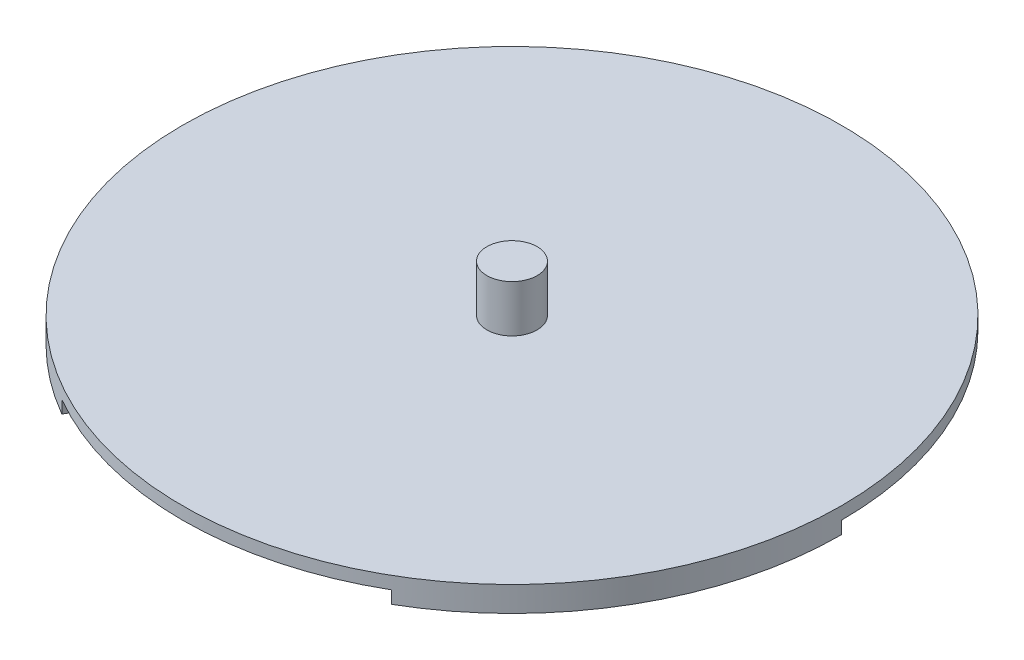
ISO-10303-21;
HEADER;
FILE_DESCRIPTION(('STEP AP214'),'2;1');
FILE_NAME('part.step','',(''),(''),'','','');
FILE_SCHEMA(('AUTOMOTIVE_DESIGN { 1 0 10303 214 1 1 1 1 }'));
ENDSEC;
DATA;
#1=APPLICATION_CONTEXT('core data for automotive mechanical design processes');
#2=APPLICATION_PROTOCOL_DEFINITION('international standard','automotive_design',2000,#1);
#3=PRODUCT_CONTEXT('',#1,'mechanical');
#4=PRODUCT('Part','Part','',(#3));
#5=PRODUCT_RELATED_PRODUCT_CATEGORY('part','',(#4));
#6=PRODUCT_DEFINITION_FORMATION('','',#4);
#7=PRODUCT_DEFINITION_CONTEXT('part definition',#1,'design');
#8=PRODUCT_DEFINITION('design','',#6,#7);
#9=PRODUCT_DEFINITION_SHAPE('','',#8);
#10=(LENGTH_UNIT() NAMED_UNIT(*) SI_UNIT(.MILLI.,.METRE.));
#11=(NAMED_UNIT(*) PLANE_ANGLE_UNIT() SI_UNIT($,.RADIAN.));
#12=(NAMED_UNIT(*) SI_UNIT($,.STERADIAN.) SOLID_ANGLE_UNIT());
#13=UNCERTAINTY_MEASURE_WITH_UNIT(LENGTH_MEASURE(1.E-05),#10,'distance_accuracy_value','');
#14=(GEOMETRIC_REPRESENTATION_CONTEXT(3) GLOBAL_UNCERTAINTY_ASSIGNED_CONTEXT((#13)) GLOBAL_UNIT_ASSIGNED_CONTEXT((#10,
#11,#12)) REPRESENTATION_CONTEXT('',''));
#15=CARTESIAN_POINT('',(0.,0.,0.));
#16=DIRECTION('',(0.,0.,1.));
#17=DIRECTION('',(1.,0.,0.));
#18=AXIS2_PLACEMENT_3D('',#15,#16,#17);
#19=CARTESIAN_POINT('',(0.,4.,0.));
#20=DIRECTION('',(0.,-1.,0.));
#21=DIRECTION('',(1.,0.,0.));
#22=AXIS2_PLACEMENT_3D('',#19,#20,#21);
#23=PLANE('',#22);
#24=CARTESIAN_POINT('',(0.,4.,0.));
#25=DIRECTION('',(0.,1.,0.));
#26=DIRECTION('',(1.,0.,0.));
#27=AXIS2_PLACEMENT_3D('',#24,#25,#26);
#28=CIRCLE('',#27,92.5);
#29=CARTESIAN_POINT('',(46.25,4.,-80.1073498500606));
#30=VERTEX_POINT('',#29);
#31=CARTESIAN_POINT('',(-46.25,4.,-80.1073498500605));
#32=VERTEX_POINT('',#31);
#33=EDGE_CURVE('E54',#30,#32,#28,.T.);
#34=ORIENTED_EDGE('',*,*,#33,.F.);
#35=DIRECTION('',(-0.5,0.,0.866025403784439));
#36=VECTOR('',#35,1.);
#37=CARTESIAN_POINT('',(46.25,4.,-80.1073498500606));
#38=LINE('',#37,#36);
#39=CARTESIAN_POINT('',(52.4999999999999,4.,-90.932667397366));
#40=VERTEX_POINT('',#39);
#41=EDGE_CURVE('E260',#40,#30,#38,.T.);
#42=ORIENTED_EDGE('',*,*,#41,.F.);
#43=CARTESIAN_POINT('',(0.,4.,0.));
#44=DIRECTION('',(0.,-1.,0.));
#45=DIRECTION('',(1.,0.,0.));
#46=AXIS2_PLACEMENT_3D('',#43,#44,#45);
#47=CIRCLE('',#46,105.);
#48=CARTESIAN_POINT('',(105.,4.,0.));
#49=VERTEX_POINT('',#48);
#50=EDGE_CURVE('E149',#40,#49,#47,.T.);
#51=ORIENTED_EDGE('',*,*,#50,.T.);
#52=DIRECTION('',(-1.,0.,0.));
#53=VECTOR('',#52,1.);
#54=CARTESIAN_POINT('',(105.,4.,0.));
#55=LINE('',#54,#53);
#56=CARTESIAN_POINT('',(92.5,4.,0.));
#57=VERTEX_POINT('',#56);
#58=EDGE_CURVE('E192',#49,#57,#55,.T.);
#59=ORIENTED_EDGE('',*,*,#58,.T.);
#60=CARTESIAN_POINT('',(0.,4.,0.));
#61=DIRECTION('',(0.,-1.,0.));
#62=DIRECTION('',(1.,0.,0.));
#63=AXIS2_PLACEMENT_3D('',#60,#61,#62);
#64=CIRCLE('',#63,92.5);
#65=CARTESIAN_POINT('',(46.25,4.,80.1073498500606));
#66=VERTEX_POINT('',#65);
#67=EDGE_CURVE('E182',#57,#66,#64,.T.);
#68=ORIENTED_EDGE('',*,*,#67,.T.);
#69=DIRECTION('',(0.5,0.,0.866025403784439));
#70=VECTOR('',#69,1.);
#71=CARTESIAN_POINT('',(46.25,4.,80.1073498500606));
#72=LINE('',#71,#70);
#73=CARTESIAN_POINT('',(52.4999999999999,4.,90.932667397366));
#74=VERTEX_POINT('',#73);
#75=EDGE_CURVE('E185',#66,#74,#72,.T.);
#76=ORIENTED_EDGE('',*,*,#75,.T.);
#77=CARTESIAN_POINT('',(-52.5,4.,90.9326673973661));
#78=VERTEX_POINT('',#77);
#79=EDGE_CURVE('E189',#74,#78,#47,.T.);
#80=ORIENTED_EDGE('',*,*,#79,.T.);
#81=DIRECTION('',(-0.5,0.,0.866025403784439));
#82=VECTOR('',#81,1.);
#83=CARTESIAN_POINT('',(-52.5,4.,90.9326673973661));
#84=LINE('',#83,#82);
#85=CARTESIAN_POINT('',(-46.25,4.,80.1073498500607));
#86=VERTEX_POINT('',#85);
#87=EDGE_CURVE('E153',#86,#78,#84,.T.);
#88=ORIENTED_EDGE('',*,*,#87,.F.);
#89=CARTESIAN_POINT('',(0.,4.,0.));
#90=DIRECTION('',(0.,1.,0.));
#91=DIRECTION('',(1.,0.,0.));
#92=AXIS2_PLACEMENT_3D('',#89,#90,#91);
#93=CIRCLE('',#92,92.5);
#94=CARTESIAN_POINT('',(-92.5000000000001,4.,0.));
#95=VERTEX_POINT('',#94);
#96=EDGE_CURVE('E150',#95,#86,#93,.T.);
#97=ORIENTED_EDGE('',*,*,#96,.F.);
#98=DIRECTION('',(1.,0.,0.));
#99=VECTOR('',#98,1.);
#100=CARTESIAN_POINT('',(-92.5000000000001,4.,0.));
#101=LINE('',#100,#99);
#102=CARTESIAN_POINT('',(-105.,4.,0.));
#103=VERTEX_POINT('',#102);
#104=EDGE_CURVE('E163',#103,#95,#101,.T.);
#105=ORIENTED_EDGE('',*,*,#104,.F.);
#106=CARTESIAN_POINT('',(-52.5,4.,-90.932667397366));
#107=VERTEX_POINT('',#106);
#108=EDGE_CURVE('E193',#103,#107,#47,.T.);
#109=ORIENTED_EDGE('',*,*,#108,.T.);
#110=DIRECTION('',(-0.499999999999999,0.,-0.866025403784439));
#111=VECTOR('',#110,1.);
#112=CARTESIAN_POINT('',(-52.5,4.,-90.932667397366));
#113=LINE('',#112,#111);
#114=EDGE_CURVE('E59',#32,#107,#113,.T.);
#115=ORIENTED_EDGE('',*,*,#114,.F.);
#116=EDGE_LOOP('',(#34,#42,#51,#59,#68,#76,#80,#88,#97,#105,#109,#115));
#117=FACE_BOUND('',#116,.T.);
#118=ADVANCED_FACE('F39',(#117),#23,.T.);
#119=CARTESIAN_POINT('',(0.,8.,0.));
#120=DIRECTION('',(0.,-1.,0.));
#121=DIRECTION('',(1.,0.,0.));
#122=AXIS2_PLACEMENT_3D('',#119,#120,#121);
#123=CYLINDRICAL_SURFACE('',#122,105.);
#124=DIRECTION('',(0.,-1.,0.));
#125=VECTOR('',#124,1.);
#126=CARTESIAN_POINT('',(105.,4.,0.));
#127=LINE('',#126,#125);
#128=CARTESIAN_POINT('',(105.,0.,0.));
#129=VERTEX_POINT('',#128);
#130=EDGE_CURVE('E205',#49,#129,#127,.T.);
#131=ORIENTED_EDGE('',*,*,#130,.F.);
#132=ORIENTED_EDGE('',*,*,#50,.F.);
#133=DIRECTION('',(0.,1.,0.));
#134=VECTOR('',#133,1.);
#135=CARTESIAN_POINT('',(52.4999999999999,0.,-90.932667397366));
#136=LINE('',#135,#134);
#137=CARTESIAN_POINT('',(52.4999999999999,0.,-90.932667397366));
#138=VERTEX_POINT('',#137);
#139=EDGE_CURVE('E131',#138,#40,#136,.T.);
#140=ORIENTED_EDGE('',*,*,#139,.F.);
#141=CARTESIAN_POINT('',(0.,0.,0.));
#142=DIRECTION('',(0.,-1.,0.));
#143=DIRECTION('',(-1.,0.,0.));
#144=AXIS2_PLACEMENT_3D('',#141,#142,#143);
#145=CIRCLE('',#144,105.);
#146=CARTESIAN_POINT('',(-52.5,0.,-90.932667397366));
#147=VERTEX_POINT('',#146);
#148=EDGE_CURVE('E137',#147,#138,#145,.T.);
#149=ORIENTED_EDGE('',*,*,#148,.F.);
#150=DIRECTION('',(0.,1.,0.));
#151=VECTOR('',#150,1.);
#152=CARTESIAN_POINT('',(-52.5,0.,-90.932667397366));
#153=LINE('',#152,#151);
#154=EDGE_CURVE('E268',#147,#107,#153,.T.);
#155=ORIENTED_EDGE('',*,*,#154,.T.);
#156=ORIENTED_EDGE('',*,*,#108,.F.);
#157=DIRECTION('',(0.,1.,0.));
#158=VECTOR('',#157,1.);
#159=CARTESIAN_POINT('',(-105.,0.,0.));
#160=LINE('',#159,#158);
#161=CARTESIAN_POINT('',(-105.,0.,0.));
#162=VERTEX_POINT('',#161);
#163=EDGE_CURVE('E174',#162,#103,#160,.T.);
#164=ORIENTED_EDGE('',*,*,#163,.F.);
#165=CARTESIAN_POINT('',(0.,0.,0.));
#166=DIRECTION('',(0.,-1.,0.));
#167=DIRECTION('',(-1.,0.,0.));
#168=AXIS2_PLACEMENT_3D('',#165,#166,#167);
#169=CIRCLE('',#168,105.);
#170=CARTESIAN_POINT('',(-52.5,0.,90.9326673973661));
#171=VERTEX_POINT('',#170);
#172=EDGE_CURVE('E165',#171,#162,#169,.T.);
#173=ORIENTED_EDGE('',*,*,#172,.F.);
#174=DIRECTION('',(0.,1.,0.));
#175=VECTOR('',#174,1.);
#176=CARTESIAN_POINT('',(-52.5,0.,90.9326673973661));
#177=LINE('',#176,#175);
#178=EDGE_CURVE('E176',#171,#78,#177,.T.);
#179=ORIENTED_EDGE('',*,*,#178,.T.);
#180=ORIENTED_EDGE('',*,*,#79,.F.);
#181=DIRECTION('',(0.,-1.,0.));
#182=VECTOR('',#181,1.);
#183=CARTESIAN_POINT('',(52.4999999999999,4.,90.932667397366));
#184=LINE('',#183,#182);
#185=CARTESIAN_POINT('',(52.4999999999999,0.,90.932667397366));
#186=VERTEX_POINT('',#185);
#187=EDGE_CURVE('E207',#74,#186,#184,.T.);
#188=ORIENTED_EDGE('',*,*,#187,.T.);
#189=CARTESIAN_POINT('',(0.,0.,0.));
#190=DIRECTION('',(0.,-1.,0.));
#191=DIRECTION('',(1.,0.,0.));
#192=AXIS2_PLACEMENT_3D('',#189,#190,#191);
#193=CIRCLE('',#192,105.);
#194=EDGE_CURVE('E204',#129,#186,#193,.T.);
#195=ORIENTED_EDGE('',*,*,#194,.F.);
#196=EDGE_LOOP('',(#131,#132,#140,#149,#155,#156,#164,#173,#179,#180,#188,#195));
#197=FACE_BOUND('',#196,.T.);
#198=CARTESIAN_POINT('',(0.,8.,0.));
#199=DIRECTION('',(0.,-1.,0.));
#200=DIRECTION('',(1.,0.,0.));
#201=AXIS2_PLACEMENT_3D('',#198,#199,#200);
#202=CIRCLE('',#201,105.);
#203=CARTESIAN_POINT('',(105.,8.,0.));
#204=VERTEX_POINT('',#203);
#205=EDGE_CURVE('E47',#204,#204,#202,.T.);
#206=ORIENTED_EDGE('',*,*,#205,.T.);
#207=EDGE_LOOP('',(#206));
#208=FACE_BOUND('',#207,.T.);
#209=ADVANCED_FACE('F41',(#197,#208),#123,.T.);
#210=CARTESIAN_POINT('',(105.,8.,0.));
#211=DIRECTION('',(0.,1.,0.));
#212=DIRECTION('',(-1.,0.,0.));
#213=AXIS2_PLACEMENT_3D('',#210,#211,#212);
#214=PLANE('',#213);
#215=CARTESIAN_POINT('',(0.,8.,0.));
#216=DIRECTION('',(0.,1.,0.));
#217=DIRECTION('',(-1.,0.,0.));
#218=AXIS2_PLACEMENT_3D('',#215,#216,#217);
#219=CIRCLE('',#218,7.99999999999999);
#220=CARTESIAN_POINT('',(-7.99999999999999,8.,0.));
#221=VERTEX_POINT('',#220);
#222=EDGE_CURVE('E11',#221,#221,#219,.T.);
#223=ORIENTED_EDGE('',*,*,#222,.F.);
#224=EDGE_LOOP('',(#223));
#225=FACE_BOUND('',#224,.T.);
#226=ORIENTED_EDGE('',*,*,#205,.F.);
#227=EDGE_LOOP('',(#226));
#228=FACE_BOUND('',#227,.T.);
#229=ADVANCED_FACE('F216',(#225,#228),#214,.T.);
#230=CARTESIAN_POINT('',(0.,0.,0.));
#231=DIRECTION('',(0.,-1.,0.));
#232=DIRECTION('',(1.,0.,0.));
#233=AXIS2_PLACEMENT_3D('',#230,#231,#232);
#234=PLANE('',#233);
#235=DIRECTION('',(-1.,0.,0.));
#236=VECTOR('',#235,1.);
#237=CARTESIAN_POINT('',(105.,0.,0.));
#238=LINE('',#237,#236);
#239=CARTESIAN_POINT('',(92.5,0.,0.));
#240=VERTEX_POINT('',#239);
#241=EDGE_CURVE('E186',#129,#240,#238,.T.);
#242=ORIENTED_EDGE('',*,*,#241,.F.);
#243=ORIENTED_EDGE('',*,*,#194,.T.);
#244=DIRECTION('',(0.5,0.,0.866025403784439));
#245=VECTOR('',#244,1.);
#246=CARTESIAN_POINT('',(46.25,0.,80.1073498500606));
#247=LINE('',#246,#245);
#248=CARTESIAN_POINT('',(46.25,0.,80.1073498500606));
#249=VERTEX_POINT('',#248);
#250=EDGE_CURVE('E198',#249,#186,#247,.T.);
#251=ORIENTED_EDGE('',*,*,#250,.F.);
#252=CARTESIAN_POINT('',(0.,0.,0.));
#253=DIRECTION('',(0.,-1.,0.));
#254=DIRECTION('',(1.,0.,0.));
#255=AXIS2_PLACEMENT_3D('',#252,#253,#254);
#256=CIRCLE('',#255,92.5);
#257=EDGE_CURVE('E181',#240,#249,#256,.T.);
#258=ORIENTED_EDGE('',*,*,#257,.F.);
#259=EDGE_LOOP('',(#242,#243,#251,#258));
#260=FACE_BOUND('',#259,.T.);
#261=ADVANCED_FACE('F218',(#260),#234,.T.);
#262=CARTESIAN_POINT('',(0.,4.,0.));
#263=DIRECTION('',(0.,-1.,0.));
#264=DIRECTION('',(1.,0.,0.));
#265=AXIS2_PLACEMENT_3D('',#262,#263,#264);
#266=CYLINDRICAL_SURFACE('',#265,92.5);
#267=ORIENTED_EDGE('',*,*,#257,.T.);
#268=DIRECTION('',(0.,-1.,0.));
#269=VECTOR('',#268,1.);
#270=CARTESIAN_POINT('',(46.25,4.,80.1073498500606));
#271=LINE('',#270,#269);
#272=EDGE_CURVE('E196',#66,#249,#271,.T.);
#273=ORIENTED_EDGE('',*,*,#272,.F.);
#274=ORIENTED_EDGE('',*,*,#67,.F.);
#275=DIRECTION('',(0.,-1.,0.));
#276=VECTOR('',#275,1.);
#277=CARTESIAN_POINT('',(92.5,4.,0.));
#278=LINE('',#277,#276);
#279=EDGE_CURVE('E202',#57,#240,#278,.T.);
#280=ORIENTED_EDGE('',*,*,#279,.T.);
#281=EDGE_LOOP('',(#267,#273,#274,#280));
#282=FACE_BOUND('',#281,.T.);
#283=ADVANCED_FACE('F225',(#282),#266,.F.);
#284=CARTESIAN_POINT('',(105.,4.,0.));
#285=DIRECTION('',(0.,0.,1.));
#286=DIRECTION('',(1.,0.,0.));
#287=AXIS2_PLACEMENT_3D('',#284,#285,#286);
#288=PLANE('',#287);
#289=ORIENTED_EDGE('',*,*,#241,.T.);
#290=ORIENTED_EDGE('',*,*,#279,.F.);
#291=ORIENTED_EDGE('',*,*,#58,.F.);
#292=ORIENTED_EDGE('',*,*,#130,.T.);
#293=EDGE_LOOP('',(#289,#290,#291,#292));
#294=FACE_BOUND('',#293,.T.);
#295=ADVANCED_FACE('F239',(#294),#288,.F.);
#296=CARTESIAN_POINT('',(46.25,4.,80.1073498500606));
#297=DIRECTION('',(0.866025403784439,0.,-0.5));
#298=DIRECTION('',(-0.5,0.,-0.866025403784439));
#299=AXIS2_PLACEMENT_3D('',#296,#297,#298);
#300=PLANE('',#299);
#301=ORIENTED_EDGE('',*,*,#250,.T.);
#302=ORIENTED_EDGE('',*,*,#187,.F.);
#303=ORIENTED_EDGE('',*,*,#75,.F.);
#304=ORIENTED_EDGE('',*,*,#272,.T.);
#305=EDGE_LOOP('',(#301,#302,#303,#304));
#306=FACE_BOUND('',#305,.T.);
#307=ADVANCED_FACE('F242',(#306),#300,.F.);
#308=CARTESIAN_POINT('',(0.,0.,0.));
#309=DIRECTION('',(0.,1.,0.));
#310=DIRECTION('',(-1.,0.,0.));
#311=AXIS2_PLACEMENT_3D('',#308,#309,#310);
#312=CYLINDRICAL_SURFACE('',#311,92.5);
#313=ORIENTED_EDGE('',*,*,#96,.T.);
#314=DIRECTION('',(0.,1.,0.));
#315=VECTOR('',#314,1.);
#316=CARTESIAN_POINT('',(-46.25,0.,80.1073498500607));
#317=LINE('',#316,#315);
#318=CARTESIAN_POINT('',(-46.25,0.,80.1073498500607));
#319=VERTEX_POINT('',#318);
#320=EDGE_CURVE('E179',#319,#86,#317,.T.);
#321=ORIENTED_EDGE('',*,*,#320,.F.);
#322=CARTESIAN_POINT('',(0.,0.,0.));
#323=DIRECTION('',(0.,1.,0.));
#324=DIRECTION('',(1.,0.,0.));
#325=AXIS2_PLACEMENT_3D('',#322,#323,#324);
#326=CIRCLE('',#325,92.5);
#327=CARTESIAN_POINT('',(-92.5000000000001,0.,0.));
#328=VERTEX_POINT('',#327);
#329=EDGE_CURVE('E159',#328,#319,#326,.T.);
#330=ORIENTED_EDGE('',*,*,#329,.F.);
#331=DIRECTION('',(0.,1.,0.));
#332=VECTOR('',#331,1.);
#333=CARTESIAN_POINT('',(-92.5000000000001,0.,0.));
#334=LINE('',#333,#332);
#335=EDGE_CURVE('E168',#328,#95,#334,.T.);
#336=ORIENTED_EDGE('',*,*,#335,.T.);
#337=EDGE_LOOP('',(#313,#321,#330,#336));
#338=FACE_BOUND('',#337,.T.);
#339=ADVANCED_FACE('F237',(#338),#312,.F.);
#340=CARTESIAN_POINT('',(-52.5,0.,90.9326673973661));
#341=DIRECTION('',(-0.866025403784439,0.,-0.5));
#342=DIRECTION('',(-0.5,0.,0.866025403784439));
#343=AXIS2_PLACEMENT_3D('',#340,#341,#342);
#344=PLANE('',#343);
#345=ORIENTED_EDGE('',*,*,#87,.T.);
#346=ORIENTED_EDGE('',*,*,#178,.F.);
#347=DIRECTION('',(-0.5,0.,0.866025403784439));
#348=VECTOR('',#347,1.);
#349=CARTESIAN_POINT('',(-52.5,0.,90.9326673973661));
#350=LINE('',#349,#348);
#351=EDGE_CURVE('E162',#319,#171,#350,.T.);
#352=ORIENTED_EDGE('',*,*,#351,.F.);
#353=ORIENTED_EDGE('',*,*,#320,.T.);
#354=EDGE_LOOP('',(#345,#346,#352,#353));
#355=FACE_BOUND('',#354,.T.);
#356=ADVANCED_FACE('F305',(#355),#344,.F.);
#357=CARTESIAN_POINT('',(-92.5000000000001,0.,0.));
#358=DIRECTION('',(0.,0.,1.));
#359=DIRECTION('',(1.,0.,0.));
#360=AXIS2_PLACEMENT_3D('',#357,#358,#359);
#361=PLANE('',#360);
#362=ORIENTED_EDGE('',*,*,#104,.T.);
#363=ORIENTED_EDGE('',*,*,#335,.F.);
#364=DIRECTION('',(1.,0.,0.));
#365=VECTOR('',#364,1.);
#366=CARTESIAN_POINT('',(-92.5000000000001,0.,0.));
#367=LINE('',#366,#365);
#368=EDGE_CURVE('E167',#162,#328,#367,.T.);
#369=ORIENTED_EDGE('',*,*,#368,.F.);
#370=ORIENTED_EDGE('',*,*,#163,.T.);
#371=EDGE_LOOP('',(#362,#363,#369,#370));
#372=FACE_BOUND('',#371,.T.);
#373=ADVANCED_FACE('F302',(#372),#361,.F.);
#374=CARTESIAN_POINT('',(0.,0.,0.));
#375=DIRECTION('',(0.,-1.,0.));
#376=DIRECTION('',(1.,0.,0.));
#377=AXIS2_PLACEMENT_3D('',#374,#375,#376);
#378=PLANE('',#377);
#379=ORIENTED_EDGE('',*,*,#329,.T.);
#380=ORIENTED_EDGE('',*,*,#351,.T.);
#381=ORIENTED_EDGE('',*,*,#172,.T.);
#382=ORIENTED_EDGE('',*,*,#368,.T.);
#383=EDGE_LOOP('',(#379,#380,#381,#382));
#384=FACE_BOUND('',#383,.T.);
#385=ADVANCED_FACE('F300',(#384),#378,.T.);
#386=CARTESIAN_POINT('',(46.25,0.,-80.1073498500606));
#387=DIRECTION('',(-0.866025403784439,0.,-0.499999999999999));
#388=DIRECTION('',(-0.5,0.,0.866025403784439));
#389=AXIS2_PLACEMENT_3D('',#386,#387,#388);
#390=PLANE('',#389);
#391=ORIENTED_EDGE('',*,*,#41,.T.);
#392=DIRECTION('',(0.,1.,0.));
#393=VECTOR('',#392,1.);
#394=CARTESIAN_POINT('',(46.25,0.,-80.1073498500606));
#395=LINE('',#394,#393);
#396=CARTESIAN_POINT('',(46.25,0.,-80.1073498500606));
#397=VERTEX_POINT('',#396);
#398=EDGE_CURVE('E133',#397,#30,#395,.T.);
#399=ORIENTED_EDGE('',*,*,#398,.F.);
#400=DIRECTION('',(-0.5,0.,0.866025403784439));
#401=VECTOR('',#400,1.);
#402=CARTESIAN_POINT('',(46.25,0.,-80.1073498500606));
#403=LINE('',#402,#401);
#404=EDGE_CURVE('E127',#138,#397,#403,.T.);
#405=ORIENTED_EDGE('',*,*,#404,.F.);
#406=ORIENTED_EDGE('',*,*,#139,.T.);
#407=EDGE_LOOP('',(#391,#399,#405,#406));
#408=FACE_BOUND('',#407,.T.);
#409=ADVANCED_FACE('F129',(#408),#390,.F.);
#410=CARTESIAN_POINT('',(0.,0.,0.));
#411=DIRECTION('',(0.,1.,0.));
#412=DIRECTION('',(-1.,0.,0.));
#413=AXIS2_PLACEMENT_3D('',#410,#411,#412);
#414=CYLINDRICAL_SURFACE('',#413,92.5);
#415=ORIENTED_EDGE('',*,*,#33,.T.);
#416=DIRECTION('',(0.,1.,0.));
#417=VECTOR('',#416,1.);
#418=CARTESIAN_POINT('',(-46.2500000000001,0.,-80.1073498500606));
#419=LINE('',#418,#417);
#420=CARTESIAN_POINT('',(-46.2500000000001,0.,-80.1073498500606));
#421=VERTEX_POINT('',#420);
#422=EDGE_CURVE('E155',#421,#32,#419,.T.);
#423=ORIENTED_EDGE('',*,*,#422,.F.);
#424=CARTESIAN_POINT('',(0.,0.,0.));
#425=DIRECTION('',(0.,1.,0.));
#426=DIRECTION('',(1.,0.,0.));
#427=AXIS2_PLACEMENT_3D('',#424,#425,#426);
#428=CIRCLE('',#427,92.5);
#429=EDGE_CURVE('E136',#397,#421,#428,.T.);
#430=ORIENTED_EDGE('',*,*,#429,.F.);
#431=ORIENTED_EDGE('',*,*,#398,.T.);
#432=EDGE_LOOP('',(#415,#423,#430,#431));
#433=FACE_BOUND('',#432,.T.);
#434=ADVANCED_FACE('F294',(#433),#414,.F.);
#435=CARTESIAN_POINT('',(-52.5,0.,-90.932667397366));
#436=DIRECTION('',(0.866025403784439,0.,-0.499999999999999));
#437=DIRECTION('',(-0.499999999999999,0.,-0.866025403784439));
#438=AXIS2_PLACEMENT_3D('',#435,#436,#437);
#439=PLANE('',#438);
#440=ORIENTED_EDGE('',*,*,#114,.T.);
#441=ORIENTED_EDGE('',*,*,#154,.F.);
#442=DIRECTION('',(-0.499999999999999,0.,-0.866025403784439));
#443=VECTOR('',#442,1.);
#444=CARTESIAN_POINT('',(-52.5,0.,-90.932667397366));
#445=LINE('',#444,#443);
#446=EDGE_CURVE('E142',#421,#147,#445,.T.);
#447=ORIENTED_EDGE('',*,*,#446,.F.);
#448=ORIENTED_EDGE('',*,*,#422,.T.);
#449=EDGE_LOOP('',(#440,#441,#447,#448));
#450=FACE_BOUND('',#449,.T.);
#451=ADVANCED_FACE('F267',(#450),#439,.F.);
#452=CARTESIAN_POINT('',(0.,0.,0.));
#453=DIRECTION('',(0.,1.,0.));
#454=DIRECTION('',(-1.,0.,0.));
#455=AXIS2_PLACEMENT_3D('',#452,#453,#454);
#456=PLANE('',#455);
#457=ORIENTED_EDGE('',*,*,#148,.T.);
#458=ORIENTED_EDGE('',*,*,#404,.T.);
#459=ORIENTED_EDGE('',*,*,#429,.T.);
#460=ORIENTED_EDGE('',*,*,#446,.T.);
#461=EDGE_LOOP('',(#457,#458,#459,#460));
#462=FACE_BOUND('',#461,.T.);
#463=ADVANCED_FACE('F140',(#462),#456,.F.);
#464=CARTESIAN_POINT('',(0.,23.,0.));
#465=DIRECTION('',(0.,-1.,0.));
#466=DIRECTION('',(0.,0.,-1.));
#467=AXIS2_PLACEMENT_3D('',#464,#465,#466);
#468=CYLINDRICAL_SURFACE('',#467,7.99999999999999);
#469=CARTESIAN_POINT('',(0.,23.,0.));
#470=DIRECTION('',(0.,-1.,0.));
#471=DIRECTION('',(0.,0.,-1.));
#472=AXIS2_PLACEMENT_3D('',#469,#470,#471);
#473=CIRCLE('',#472,7.99999999999999);
#474=CARTESIAN_POINT('',(0.,23.,-7.99999999999999));
#475=VERTEX_POINT('',#474);
#476=EDGE_CURVE('E275',#475,#475,#473,.T.);
#477=ORIENTED_EDGE('',*,*,#476,.T.);
#478=EDGE_LOOP('',(#477));
#479=FACE_BOUND('',#478,.T.);
#480=ORIENTED_EDGE('',*,*,#222,.T.);
#481=EDGE_LOOP('',(#480));
#482=FACE_BOUND('',#481,.T.);
#483=ADVANCED_FACE('F281',(#479,#482),#468,.T.);
#484=CARTESIAN_POINT('',(7.99999999999999,23.,0.));
#485=DIRECTION('',(0.,1.,0.));
#486=DIRECTION('',(0.,0.,1.));
#487=AXIS2_PLACEMENT_3D('',#484,#485,#486);
#488=PLANE('',#487);
#489=ORIENTED_EDGE('',*,*,#476,.F.);
#490=EDGE_LOOP('',(#489));
#491=FACE_BOUND('',#490,.T.);
#492=ADVANCED_FACE('F284',(#491),#488,.T.);
#493=CLOSED_SHELL('',(#118,#209,#229,#261,#283,#295,#307,#339,#356,#373,#385,#409,#434,#451,
#463,#483,#492));
#494=MANIFOLD_SOLID_BREP('B2',#493);
#495=ADVANCED_BREP_SHAPE_REPRESENTATION('',(#18,#494),#14);
#496=SHAPE_DEFINITION_REPRESENTATION(#9,#495);
ENDSEC;
END-ISO-10303-21;
